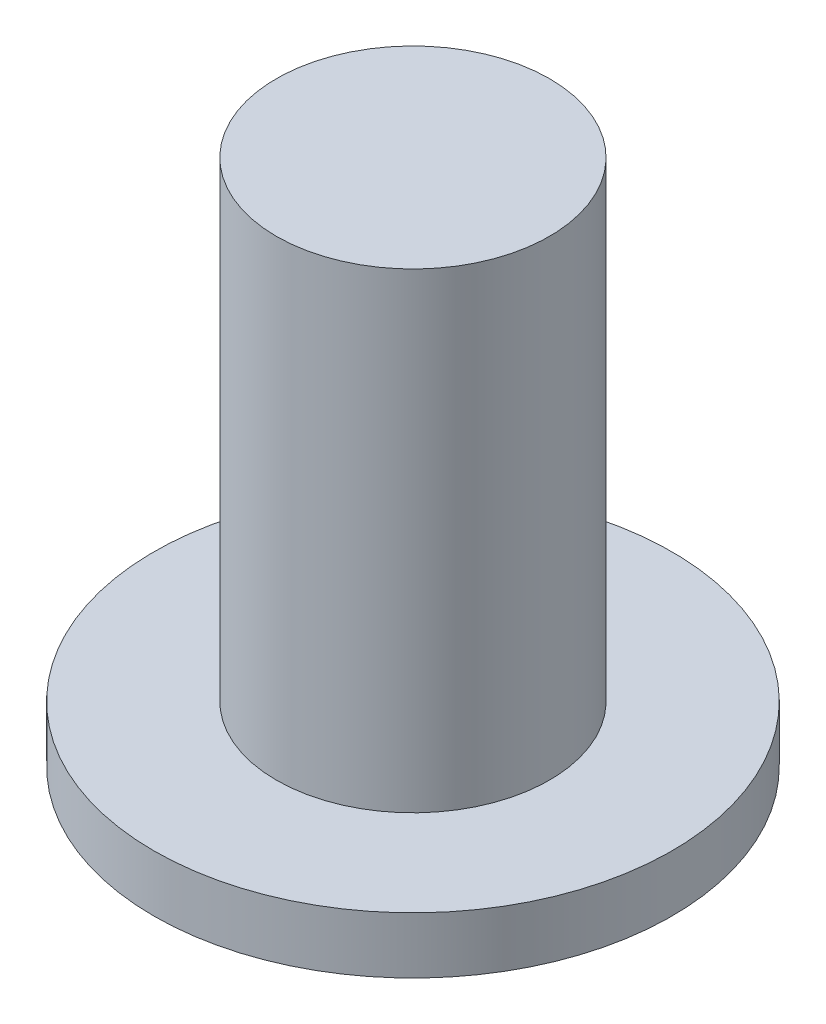
ISO-10303-21;
HEADER;
FILE_DESCRIPTION(('STEP AP214'),'2;1');
FILE_NAME('part.step','',(''),(''),'','','');
FILE_SCHEMA(('AUTOMOTIVE_DESIGN { 1 0 10303 214 1 1 1 1 }'));
ENDSEC;
DATA;
#1=APPLICATION_CONTEXT('core data for automotive mechanical design processes');
#2=APPLICATION_PROTOCOL_DEFINITION('international standard','automotive_design',2000,#1);
#3=PRODUCT_CONTEXT('',#1,'mechanical');
#4=PRODUCT('Part','Part','',(#3));
#5=PRODUCT_RELATED_PRODUCT_CATEGORY('part','',(#4));
#6=PRODUCT_DEFINITION_FORMATION('','',#4);
#7=PRODUCT_DEFINITION_CONTEXT('part definition',#1,'design');
#8=PRODUCT_DEFINITION('design','',#6,#7);
#9=PRODUCT_DEFINITION_SHAPE('','',#8);
#10=(LENGTH_UNIT() NAMED_UNIT(*) SI_UNIT(.MILLI.,.METRE.));
#11=(NAMED_UNIT(*) PLANE_ANGLE_UNIT() SI_UNIT($,.RADIAN.));
#12=(NAMED_UNIT(*) SI_UNIT($,.STERADIAN.) SOLID_ANGLE_UNIT());
#13=UNCERTAINTY_MEASURE_WITH_UNIT(LENGTH_MEASURE(1.E-05),#10,'distance_accuracy_value','');
#14=(GEOMETRIC_REPRESENTATION_CONTEXT(3) GLOBAL_UNCERTAINTY_ASSIGNED_CONTEXT((#13)) GLOBAL_UNIT_ASSIGNED_CONTEXT((#10,
#11,#12)) REPRESENTATION_CONTEXT('',''));
#15=CARTESIAN_POINT('',(0.,0.,0.));
#16=DIRECTION('',(0.,0.,1.));
#17=DIRECTION('',(1.,0.,0.));
#18=AXIS2_PLACEMENT_3D('',#15,#16,#17);
#19=CARTESIAN_POINT('',(0.,0.6,0.));
#20=DIRECTION('',(0.,-1.,0.));
#21=DIRECTION('',(0.,0.,-1.));
#22=AXIS2_PLACEMENT_3D('',#19,#20,#21);
#23=CYLINDRICAL_SURFACE('',#22,2.75);
#24=CARTESIAN_POINT('',(0.,0.6,0.));
#25=DIRECTION('',(0.,1.,0.));
#26=DIRECTION('',(0.,0.,1.));
#27=AXIS2_PLACEMENT_3D('',#24,#25,#26);
#28=CIRCLE('',#27,2.75);
#29=CARTESIAN_POINT('',(0.,0.6,2.75));
#30=VERTEX_POINT('',#29);
#31=EDGE_CURVE('E45',#30,#30,#28,.T.);
#32=ORIENTED_EDGE('',*,*,#31,.F.);
#33=EDGE_LOOP('',(#32));
#34=FACE_BOUND('',#33,.T.);
#35=CARTESIAN_POINT('',(0.,0.,0.));
#36=DIRECTION('',(0.,1.,0.));
#37=DIRECTION('',(0.,0.,1.));
#38=AXIS2_PLACEMENT_3D('',#35,#36,#37);
#39=CIRCLE('',#38,2.75);
#40=CARTESIAN_POINT('',(0.,0.,2.75));
#41=VERTEX_POINT('',#40);
#42=EDGE_CURVE('E40',#41,#41,#39,.T.);
#43=ORIENTED_EDGE('',*,*,#42,.T.);
#44=EDGE_LOOP('',(#43));
#45=FACE_BOUND('',#44,.T.);
#46=ADVANCED_FACE('F37',(#34,#45),#23,.T.);
#47=CARTESIAN_POINT('',(0.,0.6,0.));
#48=DIRECTION('',(0.,1.,0.));
#49=DIRECTION('',(0.,0.,1.));
#50=AXIS2_PLACEMENT_3D('',#47,#48,#49);
#51=PLANE('',#50);
#52=CARTESIAN_POINT('',(0.,0.6,0.));
#53=DIRECTION('',(0.,1.,0.));
#54=DIRECTION('',(0.,0.,1.));
#55=AXIS2_PLACEMENT_3D('',#52,#53,#54);
#56=CIRCLE('',#55,1.45);
#57=CARTESIAN_POINT('',(0.,0.6,1.45));
#58=VERTEX_POINT('',#57);
#59=EDGE_CURVE('E10',#58,#58,#56,.T.);
#60=ORIENTED_EDGE('',*,*,#59,.F.);
#61=EDGE_LOOP('',(#60));
#62=FACE_BOUND('',#61,.T.);
#63=ORIENTED_EDGE('',*,*,#31,.T.);
#64=EDGE_LOOP('',(#63));
#65=FACE_BOUND('',#64,.T.);
#66=ADVANCED_FACE('F65',(#62,#65),#51,.T.);
#67=CARTESIAN_POINT('',(0.,0.,0.));
#68=DIRECTION('',(0.,1.,0.));
#69=DIRECTION('',(0.,0.,1.));
#70=AXIS2_PLACEMENT_3D('',#67,#68,#69);
#71=PLANE('',#70);
#72=ORIENTED_EDGE('',*,*,#42,.F.);
#73=EDGE_LOOP('',(#72));
#74=FACE_BOUND('',#73,.T.);
#75=ADVANCED_FACE('F62',(#74),#71,.F.);
#76=CARTESIAN_POINT('',(0.,5.6,0.));
#77=DIRECTION('',(0.,-1.,0.));
#78=DIRECTION('',(0.,0.,-1.));
#79=AXIS2_PLACEMENT_3D('',#76,#77,#78);
#80=CYLINDRICAL_SURFACE('',#79,1.45);
#81=CARTESIAN_POINT('',(0.,5.6,0.));
#82=DIRECTION('',(0.,1.,0.));
#83=DIRECTION('',(0.,0.,1.));
#84=AXIS2_PLACEMENT_3D('',#81,#82,#83);
#85=CIRCLE('',#84,1.45);
#86=CARTESIAN_POINT('',(0.,5.6,1.45));
#87=VERTEX_POINT('',#86);
#88=EDGE_CURVE('E52',#87,#87,#85,.T.);
#89=ORIENTED_EDGE('',*,*,#88,.F.);
#90=EDGE_LOOP('',(#89));
#91=FACE_BOUND('',#90,.T.);
#92=ORIENTED_EDGE('',*,*,#59,.T.);
#93=EDGE_LOOP('',(#92));
#94=FACE_BOUND('',#93,.T.);
#95=ADVANCED_FACE('F64',(#91,#94),#80,.T.);
#96=CARTESIAN_POINT('',(0.,5.6,0.));
#97=DIRECTION('',(0.,1.,0.));
#98=DIRECTION('',(0.,0.,1.));
#99=AXIS2_PLACEMENT_3D('',#96,#97,#98);
#100=PLANE('',#99);
#101=ORIENTED_EDGE('',*,*,#88,.T.);
#102=EDGE_LOOP('',(#101));
#103=FACE_BOUND('',#102,.T.);
#104=ADVANCED_FACE('F70',(#103),#100,.T.);
#105=CLOSED_SHELL('',(#46,#66,#75,#95,#104));
#106=MANIFOLD_SOLID_BREP('B2',#105);
#107=ADVANCED_BREP_SHAPE_REPRESENTATION('',(#18,#106),#14);
#108=SHAPE_DEFINITION_REPRESENTATION(#9,#107);
ENDSEC;
END-ISO-10303-21;
